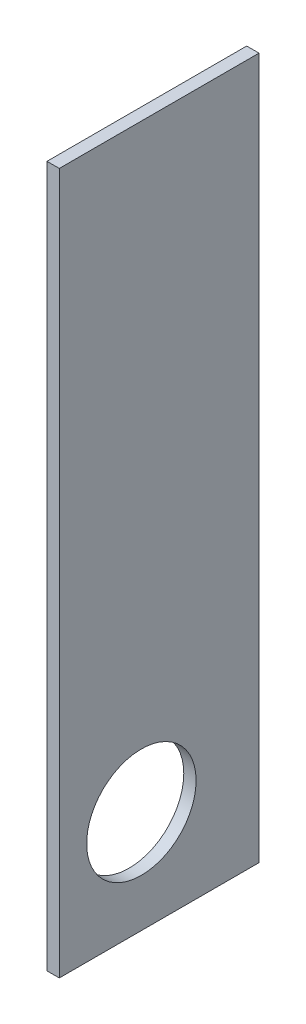
ISO-10303-21;
HEADER;
FILE_DESCRIPTION(('STEP AP214'),'2;1');
FILE_NAME('part.step','',(''),(''),'','','');
FILE_SCHEMA(('AUTOMOTIVE_DESIGN { 1 0 10303 214 1 1 1 1 }'));
ENDSEC;
DATA;
#1=APPLICATION_CONTEXT('core data for automotive mechanical design processes');
#2=APPLICATION_PROTOCOL_DEFINITION('international standard','automotive_design',2000,#1);
#3=PRODUCT_CONTEXT('',#1,'mechanical');
#4=PRODUCT('Part','Part','',(#3));
#5=PRODUCT_RELATED_PRODUCT_CATEGORY('part','',(#4));
#6=PRODUCT_DEFINITION_FORMATION('','',#4);
#7=PRODUCT_DEFINITION_CONTEXT('part definition',#1,'design');
#8=PRODUCT_DEFINITION('design','',#6,#7);
#9=PRODUCT_DEFINITION_SHAPE('','',#8);
#10=(LENGTH_UNIT() NAMED_UNIT(*) SI_UNIT(.MILLI.,.METRE.));
#11=(NAMED_UNIT(*) PLANE_ANGLE_UNIT() SI_UNIT($,.RADIAN.));
#12=(NAMED_UNIT(*) SI_UNIT($,.STERADIAN.) SOLID_ANGLE_UNIT());
#13=UNCERTAINTY_MEASURE_WITH_UNIT(LENGTH_MEASURE(1.E-05),#10,'distance_accuracy_value','');
#14=(GEOMETRIC_REPRESENTATION_CONTEXT(3) GLOBAL_UNCERTAINTY_ASSIGNED_CONTEXT((#13)) GLOBAL_UNIT_ASSIGNED_CONTEXT((#10,
#11,#12)) REPRESENTATION_CONTEXT('',''));
#15=CARTESIAN_POINT('',(0.,0.,0.));
#16=DIRECTION('',(0.,0.,1.));
#17=DIRECTION('',(1.,0.,0.));
#18=AXIS2_PLACEMENT_3D('',#15,#16,#17);
#19=CARTESIAN_POINT('',(18.,0.,0.));
#20=DIRECTION('',(1.,0.,0.));
#21=DIRECTION('',(0.,0.,-1.));
#22=AXIS2_PLACEMENT_3D('',#19,#20,#21);
#23=PLANE('',#22);
#24=DIRECTION('',(0.,-1.,0.));
#25=VECTOR('',#24,1.);
#26=CARTESIAN_POINT('',(18.,-676.121901091653,267.607933188847));
#27=LINE('',#26,#25);
#28=CARTESIAN_POINT('',(18.,57.7804435009756,267.607933188847));
#29=VERTEX_POINT('',#28);
#30=CARTESIAN_POINT('',(18.,-967.219556499024,267.607933188847));
#31=VERTEX_POINT('',#30);
#32=EDGE_CURVE('E77',#29,#31,#27,.T.);
#33=ORIENTED_EDGE('',*,*,#32,.T.);
#34=DIRECTION('',(0.,0.,-1.));
#35=VECTOR('',#34,1.);
#36=CARTESIAN_POINT('',(18.,-967.219556499024,-24.3920668111529));
#37=LINE('',#36,#35);
#38=CARTESIAN_POINT('',(18.,-967.219556499024,-24.3920668111529));
#39=VERTEX_POINT('',#38);
#40=EDGE_CURVE('E80',#31,#39,#37,.T.);
#41=ORIENTED_EDGE('',*,*,#40,.T.);
#42=DIRECTION('',(0.,1.,0.));
#43=VECTOR('',#42,1.);
#44=CARTESIAN_POINT('',(18.,-967.219556499024,-24.3920668111529));
#45=LINE('',#44,#43);
#46=CARTESIAN_POINT('',(18.,57.7804435009756,-24.3920668111529));
#47=VERTEX_POINT('',#46);
#48=EDGE_CURVE('E84',#39,#47,#45,.T.);
#49=ORIENTED_EDGE('',*,*,#48,.T.);
#50=DIRECTION('',(0.,0.,1.));
#51=VECTOR('',#50,1.);
#52=CARTESIAN_POINT('',(18.,57.7804435009756,-24.3920668111529));
#53=LINE('',#52,#51);
#54=EDGE_CURVE('E48',#47,#29,#53,.T.);
#55=ORIENTED_EDGE('',*,*,#54,.T.);
#56=EDGE_LOOP('',(#33,#41,#49,#55));
#57=FACE_BOUND('',#56,.T.);
#58=CARTESIAN_POINT('',(18.,-817.219556499024,147.607933188847));
#59=DIRECTION('',(1.,0.,0.));
#60=DIRECTION('',(0.,0.,-1.));
#61=AXIS2_PLACEMENT_3D('',#58,#59,#60);
#62=CIRCLE('',#61,80.);
#63=CARTESIAN_POINT('',(18.,-817.219556499024,67.607933188847));
#64=VERTEX_POINT('',#63);
#65=EDGE_CURVE('E97',#64,#64,#62,.T.);
#66=ORIENTED_EDGE('',*,*,#65,.F.);
#67=EDGE_LOOP('',(#66));
#68=FACE_BOUND('',#67,.T.);
#69=ADVANCED_FACE('F31',(#57,#68),#23,.T.);
#70=CARTESIAN_POINT('',(0.,0.,0.));
#71=DIRECTION('',(1.,0.,0.));
#72=DIRECTION('',(0.,0.,-1.));
#73=AXIS2_PLACEMENT_3D('',#70,#71,#72);
#74=PLANE('',#73);
#75=DIRECTION('',(0.,-1.,0.));
#76=VECTOR('',#75,1.);
#77=CARTESIAN_POINT('',(0.,-967.219556499024,267.607933188847));
#78=LINE('',#77,#76);
#79=CARTESIAN_POINT('',(0.,57.7804435009756,267.607933188847));
#80=VERTEX_POINT('',#79);
#81=CARTESIAN_POINT('',(0.,-967.219556499024,267.607933188847));
#82=VERTEX_POINT('',#81);
#83=EDGE_CURVE('E72',#80,#82,#78,.T.);
#84=ORIENTED_EDGE('',*,*,#83,.F.);
#85=DIRECTION('',(0.,0.,1.));
#86=VECTOR('',#85,1.);
#87=CARTESIAN_POINT('',(0.,57.7804435009756,-24.3920668111529));
#88=LINE('',#87,#86);
#89=CARTESIAN_POINT('',(0.,57.7804435009756,-24.3920668111529));
#90=VERTEX_POINT('',#89);
#91=EDGE_CURVE('E100',#90,#80,#88,.T.);
#92=ORIENTED_EDGE('',*,*,#91,.F.);
#93=DIRECTION('',(0.,1.,0.));
#94=VECTOR('',#93,1.);
#95=CARTESIAN_POINT('',(0.,-967.219556499024,-24.3920668111529));
#96=LINE('',#95,#94);
#97=CARTESIAN_POINT('',(0.,-967.219556499024,-24.3920668111529));
#98=VERTEX_POINT('',#97);
#99=EDGE_CURVE('E65',#98,#90,#96,.T.);
#100=ORIENTED_EDGE('',*,*,#99,.F.);
#101=DIRECTION('',(0.,0.,-1.));
#102=VECTOR('',#101,1.);
#103=CARTESIAN_POINT('',(0.,-967.219556499024,-24.3920668111529));
#104=LINE('',#103,#102);
#105=EDGE_CURVE('E88',#82,#98,#104,.T.);
#106=ORIENTED_EDGE('',*,*,#105,.F.);
#107=EDGE_LOOP('',(#84,#92,#100,#106));
#108=FACE_BOUND('',#107,.T.);
#109=CARTESIAN_POINT('',(0.,-817.219556499024,147.607933188847));
#110=DIRECTION('',(1.,0.,0.));
#111=DIRECTION('',(0.,0.,-1.));
#112=AXIS2_PLACEMENT_3D('',#109,#110,#111);
#113=CIRCLE('',#112,80.);
#114=CARTESIAN_POINT('',(0.,-817.219556499024,67.607933188847));
#115=VERTEX_POINT('',#114);
#116=EDGE_CURVE('E112',#115,#115,#113,.T.);
#117=ORIENTED_EDGE('',*,*,#116,.T.);
#118=EDGE_LOOP('',(#117));
#119=FACE_BOUND('',#118,.T.);
#120=ADVANCED_FACE('F106',(#108,#119),#74,.F.);
#121=CARTESIAN_POINT('',(18.,-967.219556499024,267.607933188847));
#122=DIRECTION('',(0.,0.,-1.));
#123=DIRECTION('',(-1.,0.,0.));
#124=AXIS2_PLACEMENT_3D('',#121,#122,#123);
#125=PLANE('',#124);
#126=ORIENTED_EDGE('',*,*,#83,.T.);
#127=DIRECTION('',(-1.,0.,0.));
#128=VECTOR('',#127,1.);
#129=CARTESIAN_POINT('',(18.,-967.219556499024,267.607933188847));
#130=LINE('',#129,#128);
#131=EDGE_CURVE('E11',#31,#82,#130,.T.);
#132=ORIENTED_EDGE('',*,*,#131,.F.);
#133=ORIENTED_EDGE('',*,*,#32,.F.);
#134=DIRECTION('',(-1.,0.,0.));
#135=VECTOR('',#134,1.);
#136=CARTESIAN_POINT('',(18.,57.7804435009756,267.607933188847));
#137=LINE('',#136,#135);
#138=EDGE_CURVE('E92',#29,#80,#137,.T.);
#139=ORIENTED_EDGE('',*,*,#138,.T.);
#140=EDGE_LOOP('',(#126,#132,#133,#139));
#141=FACE_BOUND('',#140,.T.);
#142=ADVANCED_FACE('F33',(#141),#125,.F.);
#143=CARTESIAN_POINT('',(18.,-967.219556499024,-24.3920668111529));
#144=DIRECTION('',(0.,1.,0.));
#145=DIRECTION('',(0.,0.,1.));
#146=AXIS2_PLACEMENT_3D('',#143,#144,#145);
#147=PLANE('',#146);
#148=ORIENTED_EDGE('',*,*,#105,.T.);
#149=DIRECTION('',(-1.,0.,0.));
#150=VECTOR('',#149,1.);
#151=CARTESIAN_POINT('',(18.,-967.219556499024,-24.3920668111529));
#152=LINE('',#151,#150);
#153=EDGE_CURVE('E40',#39,#98,#152,.T.);
#154=ORIENTED_EDGE('',*,*,#153,.F.);
#155=ORIENTED_EDGE('',*,*,#40,.F.);
#156=ORIENTED_EDGE('',*,*,#131,.T.);
#157=EDGE_LOOP('',(#148,#154,#155,#156));
#158=FACE_BOUND('',#157,.T.);
#159=ADVANCED_FACE('F87',(#158),#147,.F.);
#160=CARTESIAN_POINT('',(18.,-967.219556499024,-24.3920668111529));
#161=DIRECTION('',(0.,0.,1.));
#162=DIRECTION('',(1.,0.,0.));
#163=AXIS2_PLACEMENT_3D('',#160,#161,#162);
#164=PLANE('',#163);
#165=ORIENTED_EDGE('',*,*,#99,.T.);
#166=DIRECTION('',(-1.,0.,0.));
#167=VECTOR('',#166,1.);
#168=CARTESIAN_POINT('',(18.,57.7804435009756,-24.3920668111529));
#169=LINE('',#168,#167);
#170=EDGE_CURVE('E89',#47,#90,#169,.T.);
#171=ORIENTED_EDGE('',*,*,#170,.F.);
#172=ORIENTED_EDGE('',*,*,#48,.F.);
#173=ORIENTED_EDGE('',*,*,#153,.T.);
#174=EDGE_LOOP('',(#165,#171,#172,#173));
#175=FACE_BOUND('',#174,.T.);
#176=ADVANCED_FACE('F90',(#175),#164,.F.);
#177=CARTESIAN_POINT('',(18.,57.7804435009756,-24.3920668111529));
#178=DIRECTION('',(0.,-1.,0.));
#179=DIRECTION('',(0.,0.,-1.));
#180=AXIS2_PLACEMENT_3D('',#177,#178,#179);
#181=PLANE('',#180);
#182=ORIENTED_EDGE('',*,*,#91,.T.);
#183=ORIENTED_EDGE('',*,*,#138,.F.);
#184=ORIENTED_EDGE('',*,*,#54,.F.);
#185=ORIENTED_EDGE('',*,*,#170,.T.);
#186=EDGE_LOOP('',(#182,#183,#184,#185));
#187=FACE_BOUND('',#186,.T.);
#188=ADVANCED_FACE('F105',(#187),#181,.F.);
#189=CARTESIAN_POINT('',(18.,-817.219556499024,147.607933188847));
#190=DIRECTION('',(-1.,0.,0.));
#191=DIRECTION('',(0.,0.,1.));
#192=AXIS2_PLACEMENT_3D('',#189,#190,#191);
#193=CYLINDRICAL_SURFACE('',#192,80.);
#194=ORIENTED_EDGE('',*,*,#65,.T.);
#195=EDGE_LOOP('',(#194));
#196=FACE_BOUND('',#195,.T.);
#197=ORIENTED_EDGE('',*,*,#116,.F.);
#198=EDGE_LOOP('',(#197));
#199=FACE_BOUND('',#198,.T.);
#200=ADVANCED_FACE('F119',(#196,#199),#193,.F.);
#201=CLOSED_SHELL('',(#69,#120,#142,#159,#176,#188,#200));
#202=MANIFOLD_SOLID_BREP('B2',#201);
#203=ADVANCED_BREP_SHAPE_REPRESENTATION('',(#18,#202),#14);
#204=SHAPE_DEFINITION_REPRESENTATION(#9,#203);
ENDSEC;
END-ISO-10303-21;
